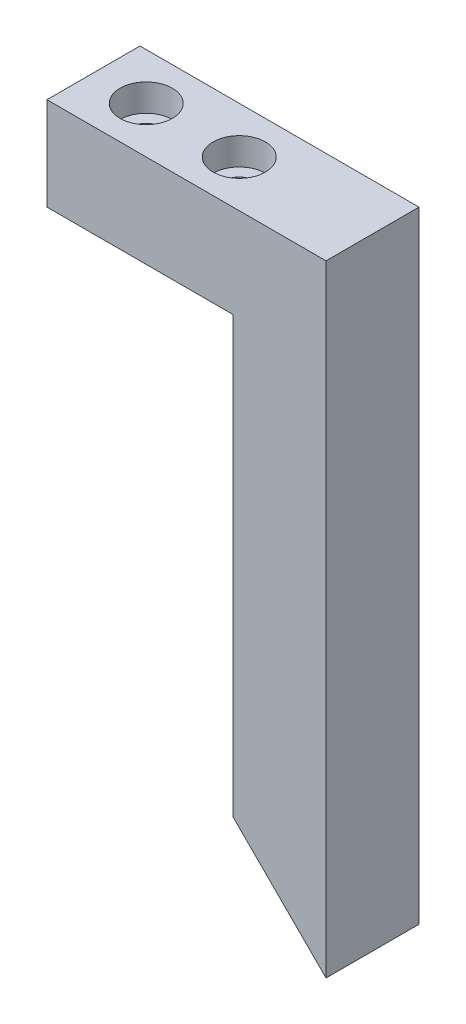
ISO-10303-21;
HEADER;
FILE_DESCRIPTION(('STEP AP214'),'2;1');
FILE_NAME('part.step','',(''),(''),'','','');
FILE_SCHEMA(('AUTOMOTIVE_DESIGN { 1 0 10303 214 1 1 1 1 }'));
ENDSEC;
DATA;
#1=APPLICATION_CONTEXT('core data for automotive mechanical design processes');
#2=APPLICATION_PROTOCOL_DEFINITION('international standard','automotive_design',2000,#1);
#3=PRODUCT_CONTEXT('',#1,'mechanical');
#4=PRODUCT('Part','Part','',(#3));
#5=PRODUCT_RELATED_PRODUCT_CATEGORY('part','',(#4));
#6=PRODUCT_DEFINITION_FORMATION('','',#4);
#7=PRODUCT_DEFINITION_CONTEXT('part definition',#1,'design');
#8=PRODUCT_DEFINITION('design','',#6,#7);
#9=PRODUCT_DEFINITION_SHAPE('','',#8);
#10=(LENGTH_UNIT() NAMED_UNIT(*) SI_UNIT(.MILLI.,.METRE.));
#11=(NAMED_UNIT(*) PLANE_ANGLE_UNIT() SI_UNIT($,.RADIAN.));
#12=(NAMED_UNIT(*) SI_UNIT($,.STERADIAN.) SOLID_ANGLE_UNIT());
#13=UNCERTAINTY_MEASURE_WITH_UNIT(LENGTH_MEASURE(1.E-05),#10,'distance_accuracy_value','');
#14=(GEOMETRIC_REPRESENTATION_CONTEXT(3) GLOBAL_UNCERTAINTY_ASSIGNED_CONTEXT((#13)) GLOBAL_UNIT_ASSIGNED_CONTEXT((#10,
#11,#12)) REPRESENTATION_CONTEXT('',''));
#15=CARTESIAN_POINT('',(0.,0.,0.));
#16=DIRECTION('',(0.,0.,1.));
#17=DIRECTION('',(1.,0.,0.));
#18=AXIS2_PLACEMENT_3D('',#15,#16,#17);
#19=CARTESIAN_POINT('',(0.,0.,6.35));
#20=DIRECTION('',(1.,0.,0.));
#21=DIRECTION('',(0.,1.,0.));
#22=AXIS2_PLACEMENT_3D('',#19,#20,#21);
#23=PLANE('',#22);
#24=DIRECTION('',(0.,-1.,0.));
#25=VECTOR('',#24,1.);
#26=CARTESIAN_POINT('',(0.,0.,-6.35));
#27=LINE('',#26,#25);
#28=CARTESIAN_POINT('',(0.,0.,-6.35));
#29=VERTEX_POINT('',#28);
#30=CARTESIAN_POINT('',(0.,-12.7,-6.35));
#31=VERTEX_POINT('',#30);
#32=EDGE_CURVE('E153',#29,#31,#27,.T.);
#33=ORIENTED_EDGE('',*,*,#32,.T.);
#34=DIRECTION('',(0.,0.,1.));
#35=VECTOR('',#34,1.);
#36=CARTESIAN_POINT('',(0.,-12.7,-6.35));
#37=LINE('',#36,#35);
#38=CARTESIAN_POINT('',(0.,-12.7,6.35));
#39=VERTEX_POINT('',#38);
#40=EDGE_CURVE('E150',#31,#39,#37,.T.);
#41=ORIENTED_EDGE('',*,*,#40,.T.);
#42=DIRECTION('',(0.,-1.,0.));
#43=VECTOR('',#42,1.);
#44=CARTESIAN_POINT('',(0.,0.,6.35));
#45=LINE('',#44,#43);
#46=CARTESIAN_POINT('',(0.,0.,6.35));
#47=VERTEX_POINT('',#46);
#48=EDGE_CURVE('E156',#47,#39,#45,.T.);
#49=ORIENTED_EDGE('',*,*,#48,.F.);
#50=DIRECTION('',(0.,0.,-1.));
#51=VECTOR('',#50,1.);
#52=CARTESIAN_POINT('',(0.,0.,6.35));
#53=LINE('',#52,#51);
#54=EDGE_CURVE('E164',#47,#29,#53,.T.);
#55=ORIENTED_EDGE('',*,*,#54,.T.);
#56=EDGE_LOOP('',(#33,#41,#49,#55));
#57=FACE_BOUND('',#56,.T.);
#58=ADVANCED_FACE('F41',(#57),#23,.F.);
#59=CARTESIAN_POINT('',(38.1,0.,6.35));
#60=DIRECTION('',(-1.,0.,0.));
#61=DIRECTION('',(0.,-1.,0.));
#62=AXIS2_PLACEMENT_3D('',#59,#60,#61);
#63=PLANE('',#62);
#64=DIRECTION('',(0.,1.,0.));
#65=VECTOR('',#64,1.);
#66=CARTESIAN_POINT('',(38.1,0.,-6.35));
#67=LINE('',#66,#65);
#68=CARTESIAN_POINT('',(38.1,-84.8,-6.35));
#69=VERTEX_POINT('',#68);
#70=CARTESIAN_POINT('',(38.1,0.,-6.35));
#71=VERTEX_POINT('',#70);
#72=EDGE_CURVE('E167',#69,#71,#67,.T.);
#73=ORIENTED_EDGE('',*,*,#72,.T.);
#74=DIRECTION('',(0.,0.,-1.));
#75=VECTOR('',#74,1.);
#76=CARTESIAN_POINT('',(38.1,0.,6.35));
#77=LINE('',#76,#75);
#78=CARTESIAN_POINT('',(38.1,0.,6.35));
#79=VERTEX_POINT('',#78);
#80=EDGE_CURVE('E172',#79,#71,#77,.T.);
#81=ORIENTED_EDGE('',*,*,#80,.F.);
#82=DIRECTION('',(0.,1.,0.));
#83=VECTOR('',#82,1.);
#84=CARTESIAN_POINT('',(38.1,0.,6.35));
#85=LINE('',#84,#83);
#86=CARTESIAN_POINT('',(38.1,-84.8,6.35));
#87=VERTEX_POINT('',#86);
#88=EDGE_CURVE('E159',#87,#79,#85,.T.);
#89=ORIENTED_EDGE('',*,*,#88,.F.);
#90=DIRECTION('',(0.,0.,-1.));
#91=VECTOR('',#90,1.);
#92=CARTESIAN_POINT('',(38.1,-84.8,6.35));
#93=LINE('',#92,#91);
#94=EDGE_CURVE('E48',#87,#69,#93,.T.);
#95=ORIENTED_EDGE('',*,*,#94,.T.);
#96=EDGE_LOOP('',(#73,#81,#89,#95));
#97=FACE_BOUND('',#96,.T.);
#98=ADVANCED_FACE('F201',(#97),#63,.F.);
#99=CARTESIAN_POINT('',(0.,0.,6.35));
#100=DIRECTION('',(0.,-1.,0.));
#101=DIRECTION('',(0.,0.,-1.));
#102=AXIS2_PLACEMENT_3D('',#99,#100,#101);
#103=PLANE('',#102);
#104=CARTESIAN_POINT('',(7.2,0.,0.));
#105=DIRECTION('',(0.,1.,0.));
#106=DIRECTION('',(0.,0.,1.));
#107=AXIS2_PLACEMENT_3D('',#104,#105,#106);
#108=CIRCLE('',#107,3.57250999999999);
#109=CARTESIAN_POINT('',(7.2,0.,3.57250999999999));
#110=VERTEX_POINT('',#109);
#111=EDGE_CURVE('E121',#110,#110,#108,.T.);
#112=ORIENTED_EDGE('',*,*,#111,.F.);
#113=EDGE_LOOP('',(#112));
#114=FACE_BOUND('',#113,.T.);
#115=CARTESIAN_POINT('',(19.9,0.,0.));
#116=DIRECTION('',(0.,1.,0.));
#117=DIRECTION('',(0.,0.,1.));
#118=AXIS2_PLACEMENT_3D('',#115,#116,#117);
#119=CIRCLE('',#118,3.57250999999999);
#120=CARTESIAN_POINT('',(19.9,0.,3.57250999999999));
#121=VERTEX_POINT('',#120);
#122=EDGE_CURVE('E132',#121,#121,#119,.T.);
#123=ORIENTED_EDGE('',*,*,#122,.F.);
#124=EDGE_LOOP('',(#123));
#125=FACE_BOUND('',#124,.T.);
#126=DIRECTION('',(-1.,0.,0.));
#127=VECTOR('',#126,1.);
#128=CARTESIAN_POINT('',(0.,0.,-6.35));
#129=LINE('',#128,#127);
#130=EDGE_CURVE('E160',#71,#29,#129,.T.);
#131=ORIENTED_EDGE('',*,*,#130,.T.);
#132=ORIENTED_EDGE('',*,*,#54,.F.);
#133=DIRECTION('',(-1.,0.,0.));
#134=VECTOR('',#133,1.);
#135=CARTESIAN_POINT('',(0.,0.,6.35));
#136=LINE('',#135,#134);
#137=EDGE_CURVE('E162',#79,#47,#136,.T.);
#138=ORIENTED_EDGE('',*,*,#137,.F.);
#139=ORIENTED_EDGE('',*,*,#80,.T.);
#140=EDGE_LOOP('',(#131,#132,#138,#139));
#141=FACE_BOUND('',#140,.T.);
#142=ADVANCED_FACE('F206',(#114,#125,#141),#103,.F.);
#143=CARTESIAN_POINT('',(0.,-84.8,6.35));
#144=DIRECTION('',(0.,0.,1.));
#145=DIRECTION('',(1.,0.,0.));
#146=AXIS2_PLACEMENT_3D('',#143,#144,#145);
#147=PLANE('',#146);
#148=DIRECTION('',(-0.707106781186551,0.707106781186544,0.));
#149=VECTOR('',#148,1.);
#150=CARTESIAN_POINT('',(38.1,-84.8,6.35));
#151=LINE('',#150,#149);
#152=CARTESIAN_POINT('',(25.4,-72.1000000000001,6.35));
#153=VERTEX_POINT('',#152);
#154=EDGE_CURVE('E55',#87,#153,#151,.T.);
#155=ORIENTED_EDGE('',*,*,#154,.F.);
#156=ORIENTED_EDGE('',*,*,#88,.T.);
#157=ORIENTED_EDGE('',*,*,#137,.T.);
#158=ORIENTED_EDGE('',*,*,#48,.T.);
#159=DIRECTION('',(-1.,0.,0.));
#160=VECTOR('',#159,1.);
#161=CARTESIAN_POINT('',(0.,-12.7,6.35));
#162=LINE('',#161,#160);
#163=CARTESIAN_POINT('',(25.4,-12.7,6.35));
#164=VERTEX_POINT('',#163);
#165=EDGE_CURVE('E144',#164,#39,#162,.T.);
#166=ORIENTED_EDGE('',*,*,#165,.F.);
#167=DIRECTION('',(0.,1.,0.));
#168=VECTOR('',#167,1.);
#169=CARTESIAN_POINT('',(25.4,-84.8,6.35));
#170=LINE('',#169,#168);
#171=EDGE_CURVE('E147',#153,#164,#170,.T.);
#172=ORIENTED_EDGE('',*,*,#171,.F.);
#173=EDGE_LOOP('',(#155,#156,#157,#158,#166,#172));
#174=FACE_BOUND('',#173,.T.);
#175=ADVANCED_FACE('F221',(#174),#147,.T.);
#176=CARTESIAN_POINT('',(0.,-84.8,-6.35));
#177=DIRECTION('',(0.,0.,1.));
#178=DIRECTION('',(1.,0.,0.));
#179=AXIS2_PLACEMENT_3D('',#176,#177,#178);
#180=PLANE('',#179);
#181=ORIENTED_EDGE('',*,*,#72,.F.);
#182=DIRECTION('',(-0.707106781186551,0.707106781186544,0.));
#183=VECTOR('',#182,1.);
#184=CARTESIAN_POINT('',(38.1,-84.8,-6.35));
#185=LINE('',#184,#183);
#186=CARTESIAN_POINT('',(25.4,-72.1000000000001,-6.35));
#187=VERTEX_POINT('',#186);
#188=EDGE_CURVE('E119',#69,#187,#185,.T.);
#189=ORIENTED_EDGE('',*,*,#188,.T.);
#190=DIRECTION('',(0.,1.,0.));
#191=VECTOR('',#190,1.);
#192=CARTESIAN_POINT('',(25.4,-84.8,-6.35));
#193=LINE('',#192,#191);
#194=CARTESIAN_POINT('',(25.4,-12.7,-6.35));
#195=VERTEX_POINT('',#194);
#196=EDGE_CURVE('E62',#187,#195,#193,.T.);
#197=ORIENTED_EDGE('',*,*,#196,.T.);
#198=DIRECTION('',(-1.,0.,0.));
#199=VECTOR('',#198,1.);
#200=CARTESIAN_POINT('',(0.,-12.7,-6.35));
#201=LINE('',#200,#199);
#202=EDGE_CURVE('E143',#195,#31,#201,.T.);
#203=ORIENTED_EDGE('',*,*,#202,.T.);
#204=ORIENTED_EDGE('',*,*,#32,.F.);
#205=ORIENTED_EDGE('',*,*,#130,.F.);
#206=EDGE_LOOP('',(#181,#189,#197,#203,#204,#205));
#207=FACE_BOUND('',#206,.T.);
#208=ADVANCED_FACE('F213',(#207),#180,.F.);
#209=CARTESIAN_POINT('',(0.,-12.7,-6.35));
#210=DIRECTION('',(0.,1.,0.));
#211=DIRECTION('',(0.,0.,1.));
#212=AXIS2_PLACEMENT_3D('',#209,#210,#211);
#213=PLANE('',#212);
#214=CARTESIAN_POINT('',(7.2,-12.7,0.));
#215=DIRECTION('',(0.,1.,0.));
#216=DIRECTION('',(0.,0.,1.));
#217=AXIS2_PLACEMENT_3D('',#214,#215,#216);
#218=CIRCLE('',#217,1.89864999999999);
#219=CARTESIAN_POINT('',(7.2,-12.7,1.89864999999999));
#220=VERTEX_POINT('',#219);
#221=EDGE_CURVE('E131',#220,#220,#218,.T.);
#222=ORIENTED_EDGE('',*,*,#221,.T.);
#223=EDGE_LOOP('',(#222));
#224=FACE_BOUND('',#223,.T.);
#225=CARTESIAN_POINT('',(19.9,-12.7,0.));
#226=DIRECTION('',(0.,1.,0.));
#227=DIRECTION('',(0.,0.,1.));
#228=AXIS2_PLACEMENT_3D('',#225,#226,#227);
#229=CIRCLE('',#228,1.89864999999999);
#230=CARTESIAN_POINT('',(19.9,-12.7,1.89864999999999));
#231=VERTEX_POINT('',#230);
#232=EDGE_CURVE('E141',#231,#231,#229,.T.);
#233=ORIENTED_EDGE('',*,*,#232,.T.);
#234=EDGE_LOOP('',(#233));
#235=FACE_BOUND('',#234,.T.);
#236=ORIENTED_EDGE('',*,*,#165,.T.);
#237=ORIENTED_EDGE('',*,*,#40,.F.);
#238=ORIENTED_EDGE('',*,*,#202,.F.);
#239=DIRECTION('',(0.,0.,1.));
#240=VECTOR('',#239,1.);
#241=CARTESIAN_POINT('',(25.4,-12.7,-6.35));
#242=LINE('',#241,#240);
#243=EDGE_CURVE('E146',#195,#164,#242,.T.);
#244=ORIENTED_EDGE('',*,*,#243,.T.);
#245=EDGE_LOOP('',(#236,#237,#238,#244));
#246=FACE_BOUND('',#245,.T.);
#247=ADVANCED_FACE('F181',(#224,#235,#246),#213,.F.);
#248=CARTESIAN_POINT('',(25.4,-84.8,-6.35));
#249=DIRECTION('',(1.,0.,0.));
#250=DIRECTION('',(0.,1.,0.));
#251=AXIS2_PLACEMENT_3D('',#248,#249,#250);
#252=PLANE('',#251);
#253=ORIENTED_EDGE('',*,*,#196,.F.);
#254=DIRECTION('',(0.,0.,1.));
#255=VECTOR('',#254,1.);
#256=CARTESIAN_POINT('',(25.4,-72.1000000000001,-6.35));
#257=LINE('',#256,#255);
#258=EDGE_CURVE('E11',#187,#153,#257,.T.);
#259=ORIENTED_EDGE('',*,*,#258,.T.);
#260=ORIENTED_EDGE('',*,*,#171,.T.);
#261=ORIENTED_EDGE('',*,*,#243,.F.);
#262=EDGE_LOOP('',(#253,#259,#260,#261));
#263=FACE_BOUND('',#262,.T.);
#264=ADVANCED_FACE('F218',(#263),#252,.F.);
#265=CARTESIAN_POINT('',(19.9,0.,0.));
#266=DIRECTION('',(0.,1.,0.));
#267=DIRECTION('',(0.,0.,1.));
#268=AXIS2_PLACEMENT_3D('',#265,#266,#267);
#269=CYLINDRICAL_SURFACE('',#268,1.89864999999999);
#270=CARTESIAN_POINT('',(19.9,-3.7051996,0.));
#271=DIRECTION('',(0.,1.,0.));
#272=DIRECTION('',(0.,0.,1.));
#273=AXIS2_PLACEMENT_3D('',#270,#271,#272);
#274=CIRCLE('',#273,1.89865000000001);
#275=CARTESIAN_POINT('',(19.9,-3.7051996,1.89865000000001));
#276=VERTEX_POINT('',#275);
#277=EDGE_CURVE('E138',#276,#276,#274,.T.);
#278=ORIENTED_EDGE('',*,*,#277,.T.);
#279=EDGE_LOOP('',(#278));
#280=FACE_BOUND('',#279,.T.);
#281=ORIENTED_EDGE('',*,*,#232,.F.);
#282=EDGE_LOOP('',(#281));
#283=FACE_BOUND('',#282,.T.);
#284=ADVANCED_FACE('F289',(#280,#283),#269,.F.);
#285=CARTESIAN_POINT('',(21.79865,-3.7051996,0.));
#286=DIRECTION('',(0.,-1.,0.));
#287=DIRECTION('',(0.,0.,-1.));
#288=AXIS2_PLACEMENT_3D('',#285,#286,#287);
#289=PLANE('',#288);
#290=ORIENTED_EDGE('',*,*,#277,.F.);
#291=EDGE_LOOP('',(#290));
#292=FACE_BOUND('',#291,.T.);
#293=CARTESIAN_POINT('',(19.9,-3.7051996,0.));
#294=DIRECTION('',(0.,1.,0.));
#295=DIRECTION('',(0.,0.,1.));
#296=AXIS2_PLACEMENT_3D('',#293,#294,#295);
#297=CIRCLE('',#296,3.57251);
#298=CARTESIAN_POINT('',(19.9,-3.7051996,3.57251));
#299=VERTEX_POINT('',#298);
#300=EDGE_CURVE('E135',#299,#299,#297,.T.);
#301=ORIENTED_EDGE('',*,*,#300,.T.);
#302=EDGE_LOOP('',(#301));
#303=FACE_BOUND('',#302,.T.);
#304=ADVANCED_FACE('F197',(#292,#303),#289,.F.);
#305=CARTESIAN_POINT('',(19.9,0.,0.));
#306=DIRECTION('',(0.,1.,0.));
#307=DIRECTION('',(0.,0.,1.));
#308=AXIS2_PLACEMENT_3D('',#305,#306,#307);
#309=CYLINDRICAL_SURFACE('',#308,3.57251);
#310=ORIENTED_EDGE('',*,*,#300,.F.);
#311=EDGE_LOOP('',(#310));
#312=FACE_BOUND('',#311,.T.);
#313=ORIENTED_EDGE('',*,*,#122,.T.);
#314=EDGE_LOOP('',(#313));
#315=FACE_BOUND('',#314,.T.);
#316=ADVANCED_FACE('F187',(#312,#315),#309,.F.);
#317=CARTESIAN_POINT('',(7.2,0.,0.));
#318=DIRECTION('',(0.,1.,0.));
#319=DIRECTION('',(0.,0.,1.));
#320=AXIS2_PLACEMENT_3D('',#317,#318,#319);
#321=CYLINDRICAL_SURFACE('',#320,1.89864999999999);
#322=CARTESIAN_POINT('',(7.2,-3.7051996,0.));
#323=DIRECTION('',(0.,1.,0.));
#324=DIRECTION('',(0.,0.,1.));
#325=AXIS2_PLACEMENT_3D('',#322,#323,#324);
#326=CIRCLE('',#325,1.89865000000001);
#327=CARTESIAN_POINT('',(7.2,-3.7051996,1.89865000000001));
#328=VERTEX_POINT('',#327);
#329=EDGE_CURVE('E128',#328,#328,#326,.T.);
#330=ORIENTED_EDGE('',*,*,#329,.T.);
#331=EDGE_LOOP('',(#330));
#332=FACE_BOUND('',#331,.T.);
#333=ORIENTED_EDGE('',*,*,#221,.F.);
#334=EDGE_LOOP('',(#333));
#335=FACE_BOUND('',#334,.T.);
#336=ADVANCED_FACE('F184',(#332,#335),#321,.F.);
#337=CARTESIAN_POINT('',(9.09865000000001,-3.7051996,0.));
#338=DIRECTION('',(0.,-1.,0.));
#339=DIRECTION('',(0.,0.,-1.));
#340=AXIS2_PLACEMENT_3D('',#337,#338,#339);
#341=PLANE('',#340);
#342=ORIENTED_EDGE('',*,*,#329,.F.);
#343=EDGE_LOOP('',(#342));
#344=FACE_BOUND('',#343,.T.);
#345=CARTESIAN_POINT('',(7.2,-3.7051996,0.));
#346=DIRECTION('',(0.,1.,0.));
#347=DIRECTION('',(0.,0.,1.));
#348=AXIS2_PLACEMENT_3D('',#345,#346,#347);
#349=CIRCLE('',#348,3.57251);
#350=CARTESIAN_POINT('',(7.2,-3.7051996,3.57251));
#351=VERTEX_POINT('',#350);
#352=EDGE_CURVE('E125',#351,#351,#349,.T.);
#353=ORIENTED_EDGE('',*,*,#352,.T.);
#354=EDGE_LOOP('',(#353));
#355=FACE_BOUND('',#354,.T.);
#356=ADVANCED_FACE('F186',(#344,#355),#341,.F.);
#357=CARTESIAN_POINT('',(7.2,0.,0.));
#358=DIRECTION('',(0.,1.,0.));
#359=DIRECTION('',(0.,0.,1.));
#360=AXIS2_PLACEMENT_3D('',#357,#358,#359);
#361=CYLINDRICAL_SURFACE('',#360,3.57251);
#362=ORIENTED_EDGE('',*,*,#352,.F.);
#363=EDGE_LOOP('',(#362));
#364=FACE_BOUND('',#363,.T.);
#365=ORIENTED_EDGE('',*,*,#111,.T.);
#366=EDGE_LOOP('',(#365));
#367=FACE_BOUND('',#366,.T.);
#368=ADVANCED_FACE('F194',(#364,#367),#361,.F.);
#369=CARTESIAN_POINT('',(38.1,-84.8,-6.35));
#370=DIRECTION('',(0.707106781186543,0.707106781186551,0.));
#371=DIRECTION('',(-0.707106781186551,0.707106781186544,0.));
#372=AXIS2_PLACEMENT_3D('',#369,#370,#371);
#373=PLANE('',#372);
#374=CARTESIAN_POINT('',(31.75,-78.4500000000001,-3.175));
#375=DIRECTION('',(-0.707106781186544,-0.707106781186551,0.));
#376=DIRECTION('',(0.707106781186551,-0.707106781186544,0.));
#377=AXIS2_PLACEMENT_3D('',#374,#375,#376);
#378=CIRCLE('',#377,1.13029999999999);
#379=CARTESIAN_POINT('',(32.5492427947752,-79.2492427947752,-3.175));
#380=VERTEX_POINT('',#379);
#381=EDGE_CURVE('E109',#380,#380,#378,.T.);
#382=ORIENTED_EDGE('',*,*,#381,.F.);
#383=EDGE_LOOP('',(#382));
#384=FACE_BOUND('',#383,.T.);
#385=CARTESIAN_POINT('',(31.75,-78.4500000000001,3.175));
#386=DIRECTION('',(-0.707106781186544,-0.707106781186551,0.));
#387=DIRECTION('',(0.707106781186551,-0.707106781186544,0.));
#388=AXIS2_PLACEMENT_3D('',#385,#386,#387);
#389=CIRCLE('',#388,1.13029999999999);
#390=CARTESIAN_POINT('',(32.5492427947752,-79.2492427947752,3.175));
#391=VERTEX_POINT('',#390);
#392=EDGE_CURVE('E108',#391,#391,#389,.T.);
#393=ORIENTED_EDGE('',*,*,#392,.F.);
#394=EDGE_LOOP('',(#393));
#395=FACE_BOUND('',#394,.T.);
#396=ORIENTED_EDGE('',*,*,#188,.F.);
#397=ORIENTED_EDGE('',*,*,#94,.F.);
#398=ORIENTED_EDGE('',*,*,#154,.T.);
#399=ORIENTED_EDGE('',*,*,#258,.F.);
#400=EDGE_LOOP('',(#396,#397,#398,#399));
#401=FACE_BOUND('',#400,.T.);
#402=ADVANCED_FACE('F226',(#384,#395,#401),#373,.F.);
#403=CARTESIAN_POINT('',(37.1169404692059,-73.0830595307941,3.175));
#404=DIRECTION('',(-0.707106781186544,-0.707106781186551,0.));
#405=DIRECTION('',(0.707106781186551,-0.707106781186544,0.));
#406=AXIS2_PLACEMENT_3D('',#403,#404,#405);
#407=CONICAL_SURFACE('',#406,1.1303,1.02974425867665);
#408=CARTESIAN_POINT('',(37.5971739896278,-72.6028260103722,3.175));
#409=VERTEX_POINT('',#408);
#410=VERTEX_LOOP('',#409);
#411=FACE_BOUND('',#410,.T.);
#412=CARTESIAN_POINT('',(37.1169404692059,-73.0830595307941,3.175));
#413=DIRECTION('',(-0.707106781186544,-0.707106781186551,0.));
#414=DIRECTION('',(0.707106781186551,-0.707106781186544,0.));
#415=AXIS2_PLACEMENT_3D('',#412,#413,#414);
#416=CIRCLE('',#415,1.1303);
#417=CARTESIAN_POINT('',(37.916183263981,-73.8823023255693,3.175));
#418=VERTEX_POINT('',#417);
#419=EDGE_CURVE('E112',#418,#418,#416,.T.);
#420=ORIENTED_EDGE('',*,*,#419,.T.);
#421=EDGE_LOOP('',(#420));
#422=FACE_BOUND('',#421,.T.);
#423=ADVANCED_FACE('F228',(#411,#422),#407,.F.);
#424=CARTESIAN_POINT('',(31.75,-78.4500000000001,3.175));
#425=DIRECTION('',(-0.707106781186544,-0.707106781186551,0.));
#426=DIRECTION('',(0.707106781186551,-0.707106781186544,0.));
#427=AXIS2_PLACEMENT_3D('',#424,#425,#426);
#428=CYLINDRICAL_SURFACE('',#427,1.13029999999999);
#429=ORIENTED_EDGE('',*,*,#419,.F.);
#430=EDGE_LOOP('',(#429));
#431=FACE_BOUND('',#430,.T.);
#432=ORIENTED_EDGE('',*,*,#392,.T.);
#433=EDGE_LOOP('',(#432));
#434=FACE_BOUND('',#433,.T.);
#435=ADVANCED_FACE('F102',(#431,#434),#428,.F.);
#436=CARTESIAN_POINT('',(37.1169404692059,-73.0830595307941,-3.175));
#437=DIRECTION('',(-0.707106781186544,-0.707106781186551,0.));
#438=DIRECTION('',(0.707106781186551,-0.707106781186544,0.));
#439=AXIS2_PLACEMENT_3D('',#436,#437,#438);
#440=CONICAL_SURFACE('',#439,1.1303,1.02974425867665);
#441=CARTESIAN_POINT('',(37.5971739896278,-72.6028260103722,-3.175));
#442=VERTEX_POINT('',#441);
#443=VERTEX_LOOP('',#442);
#444=FACE_BOUND('',#443,.T.);
#445=CARTESIAN_POINT('',(37.1169404692059,-73.0830595307941,-3.175));
#446=DIRECTION('',(-0.707106781186544,-0.707106781186551,0.));
#447=DIRECTION('',(0.707106781186551,-0.707106781186544,0.));
#448=AXIS2_PLACEMENT_3D('',#445,#446,#447);
#449=CIRCLE('',#448,1.1303);
#450=CARTESIAN_POINT('',(37.916183263981,-73.8823023255693,-3.175));
#451=VERTEX_POINT('',#450);
#452=EDGE_CURVE('E106',#451,#451,#449,.T.);
#453=ORIENTED_EDGE('',*,*,#452,.T.);
#454=EDGE_LOOP('',(#453));
#455=FACE_BOUND('',#454,.T.);
#456=ADVANCED_FACE('F98',(#444,#455),#440,.F.);
#457=CARTESIAN_POINT('',(31.75,-78.4500000000001,-3.175));
#458=DIRECTION('',(-0.707106781186544,-0.707106781186551,0.));
#459=DIRECTION('',(0.707106781186551,-0.707106781186544,0.));
#460=AXIS2_PLACEMENT_3D('',#457,#458,#459);
#461=CYLINDRICAL_SURFACE('',#460,1.13029999999999);
#462=ORIENTED_EDGE('',*,*,#452,.F.);
#463=EDGE_LOOP('',(#462));
#464=FACE_BOUND('',#463,.T.);
#465=ORIENTED_EDGE('',*,*,#381,.T.);
#466=EDGE_LOOP('',(#465));
#467=FACE_BOUND('',#466,.T.);
#468=ADVANCED_FACE('F101',(#464,#467),#461,.F.);
#469=CLOSED_SHELL('',(#58,#98,#142,#175,#208,#247,#264,#284,#304,#316,#336,#356,#368,#402,#423,
#435,#456,#468));
#470=MANIFOLD_SOLID_BREP('B2',#469);
#471=ADVANCED_BREP_SHAPE_REPRESENTATION('',(#18,#470),#14);
#472=SHAPE_DEFINITION_REPRESENTATION(#9,#471);
ENDSEC;
END-ISO-10303-21;
